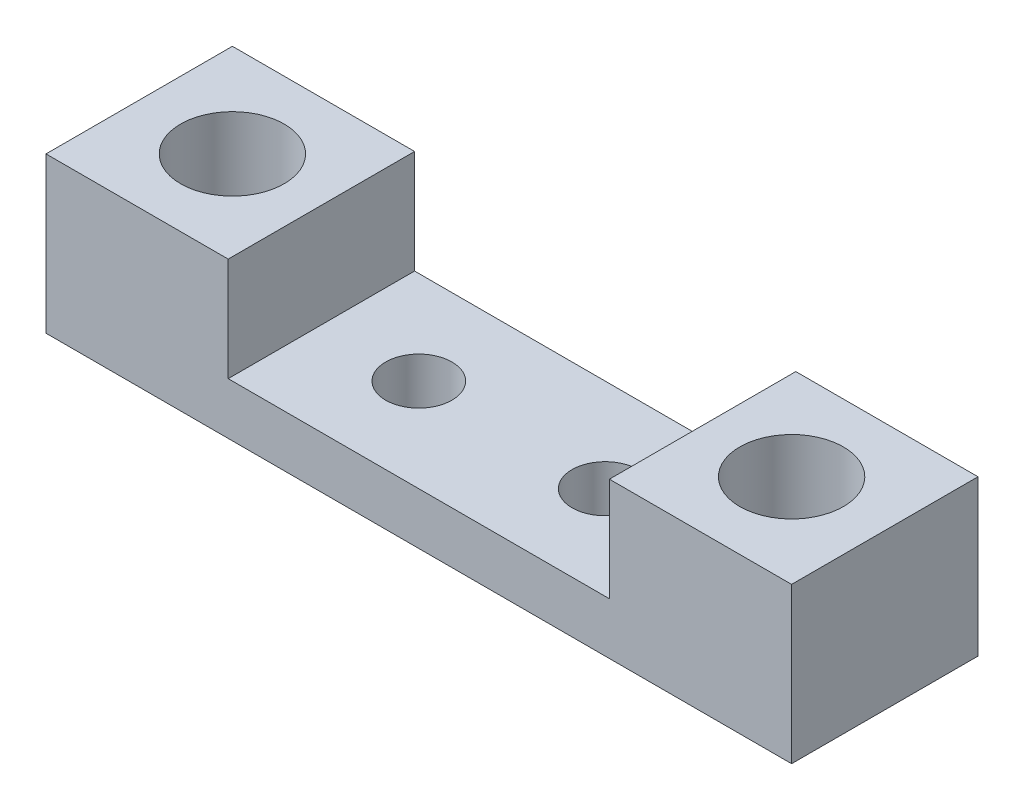
ISO-10303-21;
HEADER;
FILE_DESCRIPTION(('STEP AP214'),'2;1');
FILE_NAME('part.step','',(''),(''),'','','');
FILE_SCHEMA(('AUTOMOTIVE_DESIGN { 1 0 10303 214 1 1 1 1 }'));
ENDSEC;
DATA;
#1=APPLICATION_CONTEXT('core data for automotive mechanical design processes');
#2=APPLICATION_PROTOCOL_DEFINITION('international standard','automotive_design',2000,#1);
#3=PRODUCT_CONTEXT('',#1,'mechanical');
#4=PRODUCT('Part','Part','',(#3));
#5=PRODUCT_RELATED_PRODUCT_CATEGORY('part','',(#4));
#6=PRODUCT_DEFINITION_FORMATION('','',#4);
#7=PRODUCT_DEFINITION_CONTEXT('part definition',#1,'design');
#8=PRODUCT_DEFINITION('design','',#6,#7);
#9=PRODUCT_DEFINITION_SHAPE('','',#8);
#10=(LENGTH_UNIT() NAMED_UNIT(*) SI_UNIT(.MILLI.,.METRE.));
#11=(NAMED_UNIT(*) PLANE_ANGLE_UNIT() SI_UNIT($,.RADIAN.));
#12=(NAMED_UNIT(*) SI_UNIT($,.STERADIAN.) SOLID_ANGLE_UNIT());
#13=UNCERTAINTY_MEASURE_WITH_UNIT(LENGTH_MEASURE(1.E-05),#10,'distance_accuracy_value','');
#14=(GEOMETRIC_REPRESENTATION_CONTEXT(3) GLOBAL_UNCERTAINTY_ASSIGNED_CONTEXT((#13)) GLOBAL_UNIT_ASSIGNED_CONTEXT((#10,
#11,#12)) REPRESENTATION_CONTEXT('',''));
#15=CARTESIAN_POINT('',(0.,0.,0.));
#16=DIRECTION('',(0.,0.,1.));
#17=DIRECTION('',(1.,0.,0.));
#18=AXIS2_PLACEMENT_3D('',#15,#16,#17);
#19=CARTESIAN_POINT('',(0.,2.5,0.));
#20=DIRECTION('',(0.,1.,0.));
#21=DIRECTION('',(0.,0.,1.));
#22=AXIS2_PLACEMENT_3D('',#19,#20,#21);
#23=PLANE('',#22);
#24=CARTESIAN_POINT('',(-4.3541437719583,2.5,0.));
#25=DIRECTION('',(0.,1.,0.));
#26=DIRECTION('',(0.,0.,1.));
#27=AXIS2_PLACEMENT_3D('',#24,#25,#26);
#28=CIRCLE('',#27,1.6);
#29=CARTESIAN_POINT('',(-4.3541437719583,2.5,1.6));
#30=VERTEX_POINT('',#29);
#31=EDGE_CURVE('E162',#30,#30,#28,.T.);
#32=ORIENTED_EDGE('',*,*,#31,.F.);
#33=EDGE_LOOP('',(#32));
#34=FACE_BOUND('',#33,.T.);
#35=CARTESIAN_POINT('',(-13.3541437719583,2.5,0.));
#36=DIRECTION('',(0.,1.,0.));
#37=DIRECTION('',(0.,0.,1.));
#38=AXIS2_PLACEMENT_3D('',#35,#36,#37);
#39=CIRCLE('',#38,1.6);
#40=CARTESIAN_POINT('',(-13.3541437719583,2.5,1.6));
#41=VERTEX_POINT('',#40);
#42=EDGE_CURVE('E168',#41,#41,#39,.T.);
#43=ORIENTED_EDGE('',*,*,#42,.F.);
#44=EDGE_LOOP('',(#43));
#45=FACE_BOUND('',#44,.T.);
#46=DIRECTION('',(1.,0.,0.));
#47=VECTOR('',#46,1.);
#48=CARTESIAN_POINT('',(-26.8541437719583,2.5,4.5));
#49=LINE('',#48,#47);
#50=CARTESIAN_POINT('',(-18.0573972658692,2.5,4.5));
#51=VERTEX_POINT('',#50);
#52=CARTESIAN_POINT('',(0.349109721952637,2.5,4.5));
#53=VERTEX_POINT('',#52);
#54=EDGE_CURVE('E48',#51,#53,#49,.T.);
#55=ORIENTED_EDGE('',*,*,#54,.T.);
#56=DIRECTION('',(0.,0.,1.));
#57=VECTOR('',#56,1.);
#58=CARTESIAN_POINT('',(0.349109721952637,2.5,-4.5));
#59=LINE('',#58,#57);
#60=CARTESIAN_POINT('',(0.349109721952637,2.5,-4.5));
#61=VERTEX_POINT('',#60);
#62=EDGE_CURVE('E123',#61,#53,#59,.T.);
#63=ORIENTED_EDGE('',*,*,#62,.F.);
#64=DIRECTION('',(-1.,0.,0.));
#65=VECTOR('',#64,1.);
#66=CARTESIAN_POINT('',(-26.8541437719583,2.5,-4.5));
#67=LINE('',#66,#65);
#68=CARTESIAN_POINT('',(-18.0573972658692,2.5,-4.5));
#69=VERTEX_POINT('',#68);
#70=EDGE_CURVE('E175',#61,#69,#67,.T.);
#71=ORIENTED_EDGE('',*,*,#70,.T.);
#72=DIRECTION('',(0.,0.,-1.));
#73=VECTOR('',#72,1.);
#74=CARTESIAN_POINT('',(-18.0573972658692,2.5,-4.5));
#75=LINE('',#74,#73);
#76=EDGE_CURVE('E53',#51,#69,#75,.T.);
#77=ORIENTED_EDGE('',*,*,#76,.F.);
#78=EDGE_LOOP('',(#55,#63,#71,#77));
#79=FACE_BOUND('',#78,.T.);
#80=ADVANCED_FACE('F33',(#34,#45,#79),#23,.T.);
#81=CARTESIAN_POINT('',(0.,0.,0.));
#82=DIRECTION('',(0.,1.,0.));
#83=DIRECTION('',(0.,0.,1.));
#84=AXIS2_PLACEMENT_3D('',#81,#82,#83);
#85=PLANE('',#84);
#86=DIRECTION('',(0.,0.,1.));
#87=VECTOR('',#86,1.);
#88=CARTESIAN_POINT('',(-26.8541437719583,0.,-4.5));
#89=LINE('',#88,#87);
#90=CARTESIAN_POINT('',(-26.8541437719583,0.,-4.5));
#91=VERTEX_POINT('',#90);
#92=CARTESIAN_POINT('',(-26.8541437719583,0.,4.5));
#93=VERTEX_POINT('',#92);
#94=EDGE_CURVE('E171',#91,#93,#89,.T.);
#95=ORIENTED_EDGE('',*,*,#94,.F.);
#96=DIRECTION('',(-1.,0.,0.));
#97=VECTOR('',#96,1.);
#98=CARTESIAN_POINT('',(-26.8541437719583,0.,-4.5));
#99=LINE('',#98,#97);
#100=CARTESIAN_POINT('',(9.1458562280417,0.,-4.5));
#101=VERTEX_POINT('',#100);
#102=EDGE_CURVE('E176',#101,#91,#99,.T.);
#103=ORIENTED_EDGE('',*,*,#102,.F.);
#104=DIRECTION('',(0.,0.,-1.));
#105=VECTOR('',#104,1.);
#106=CARTESIAN_POINT('',(9.1458562280417,0.,-4.5));
#107=LINE('',#106,#105);
#108=CARTESIAN_POINT('',(9.1458562280417,0.,4.5));
#109=VERTEX_POINT('',#108);
#110=EDGE_CURVE('E104',#109,#101,#107,.T.);
#111=ORIENTED_EDGE('',*,*,#110,.F.);
#112=DIRECTION('',(1.,0.,0.));
#113=VECTOR('',#112,1.);
#114=CARTESIAN_POINT('',(-26.8541437719583,0.,4.5));
#115=LINE('',#114,#113);
#116=EDGE_CURVE('E180',#93,#109,#115,.T.);
#117=ORIENTED_EDGE('',*,*,#116,.F.);
#118=EDGE_LOOP('',(#95,#103,#111,#117));
#119=FACE_BOUND('',#118,.T.);
#120=CARTESIAN_POINT('',(-13.3541437719583,0.,0.));
#121=DIRECTION('',(0.,1.,0.));
#122=DIRECTION('',(0.,0.,1.));
#123=AXIS2_PLACEMENT_3D('',#120,#121,#122);
#124=CIRCLE('',#123,1.6);
#125=CARTESIAN_POINT('',(-13.3541437719583,0.,1.6));
#126=VERTEX_POINT('',#125);
#127=EDGE_CURVE('E165',#126,#126,#124,.T.);
#128=ORIENTED_EDGE('',*,*,#127,.T.);
#129=EDGE_LOOP('',(#128));
#130=FACE_BOUND('',#129,.T.);
#131=CARTESIAN_POINT('',(-4.3541437719583,0.,0.));
#132=DIRECTION('',(0.,1.,0.));
#133=DIRECTION('',(0.,0.,1.));
#134=AXIS2_PLACEMENT_3D('',#131,#132,#133);
#135=CIRCLE('',#134,1.6);
#136=CARTESIAN_POINT('',(-4.3541437719583,0.,1.6));
#137=VERTEX_POINT('',#136);
#138=EDGE_CURVE('E161',#137,#137,#135,.T.);
#139=ORIENTED_EDGE('',*,*,#138,.T.);
#140=EDGE_LOOP('',(#139));
#141=FACE_BOUND('',#140,.T.);
#142=CARTESIAN_POINT('',(4.6458562280417,0.,0.));
#143=DIRECTION('',(0.,1.,0.));
#144=DIRECTION('',(0.,0.,1.));
#145=AXIS2_PLACEMENT_3D('',#142,#143,#144);
#146=CIRCLE('',#145,2.5);
#147=CARTESIAN_POINT('',(4.6458562280417,0.,2.5));
#148=VERTEX_POINT('',#147);
#149=EDGE_CURVE('E158',#148,#148,#146,.T.);
#150=ORIENTED_EDGE('',*,*,#149,.T.);
#151=EDGE_LOOP('',(#150));
#152=FACE_BOUND('',#151,.T.);
#153=CARTESIAN_POINT('',(-22.3541437719583,0.,0.));
#154=DIRECTION('',(0.,1.,0.));
#155=DIRECTION('',(0.,0.,1.));
#156=AXIS2_PLACEMENT_3D('',#153,#154,#155);
#157=CIRCLE('',#156,2.5);
#158=CARTESIAN_POINT('',(-22.3541437719583,0.,2.5));
#159=VERTEX_POINT('',#158);
#160=EDGE_CURVE('E155',#159,#159,#157,.T.);
#161=ORIENTED_EDGE('',*,*,#160,.T.);
#162=EDGE_LOOP('',(#161));
#163=FACE_BOUND('',#162,.T.);
#164=ADVANCED_FACE('F188',(#119,#130,#141,#152,#163),#85,.F.);
#165=CARTESIAN_POINT('',(-26.8541437719583,2.5,-4.5));
#166=DIRECTION('',(1.,0.,0.));
#167=DIRECTION('',(0.,0.,-1.));
#168=AXIS2_PLACEMENT_3D('',#165,#166,#167);
#169=PLANE('',#168);
#170=ORIENTED_EDGE('',*,*,#94,.T.);
#171=DIRECTION('',(0.,-1.,0.));
#172=VECTOR('',#171,1.);
#173=CARTESIAN_POINT('',(-26.8541437719583,2.5,4.5));
#174=LINE('',#173,#172);
#175=CARTESIAN_POINT('',(-26.8541437719583,7.5,4.5));
#176=VERTEX_POINT('',#175);
#177=EDGE_CURVE('E11',#176,#93,#174,.T.);
#178=ORIENTED_EDGE('',*,*,#177,.F.);
#179=DIRECTION('',(0.,0.,1.));
#180=VECTOR('',#179,1.);
#181=CARTESIAN_POINT('',(-26.8541437719583,7.5,-4.5));
#182=LINE('',#181,#180);
#183=CARTESIAN_POINT('',(-26.8541437719583,7.5,-4.5));
#184=VERTEX_POINT('',#183);
#185=EDGE_CURVE('E138',#184,#176,#182,.T.);
#186=ORIENTED_EDGE('',*,*,#185,.F.);
#187=DIRECTION('',(0.,-1.,0.));
#188=VECTOR('',#187,1.);
#189=CARTESIAN_POINT('',(-26.8541437719583,2.5,-4.5));
#190=LINE('',#189,#188);
#191=EDGE_CURVE('E107',#184,#91,#190,.T.);
#192=ORIENTED_EDGE('',*,*,#191,.T.);
#193=EDGE_LOOP('',(#170,#178,#186,#192));
#194=FACE_BOUND('',#193,.T.);
#195=ADVANCED_FACE('F35',(#194),#169,.F.);
#196=CARTESIAN_POINT('',(-26.8541437719583,2.5,4.5));
#197=DIRECTION('',(0.,0.,-1.));
#198=DIRECTION('',(-1.,0.,0.));
#199=AXIS2_PLACEMENT_3D('',#196,#197,#198);
#200=PLANE('',#199);
#201=ORIENTED_EDGE('',*,*,#116,.T.);
#202=DIRECTION('',(0.,-1.,0.));
#203=VECTOR('',#202,1.);
#204=CARTESIAN_POINT('',(9.1458562280417,2.5,4.5));
#205=LINE('',#204,#203);
#206=CARTESIAN_POINT('',(9.1458562280417,7.5,4.5));
#207=VERTEX_POINT('',#206);
#208=EDGE_CURVE('E41',#207,#109,#205,.T.);
#209=ORIENTED_EDGE('',*,*,#208,.F.);
#210=DIRECTION('',(1.,0.,0.));
#211=VECTOR('',#210,1.);
#212=CARTESIAN_POINT('',(9.1458562280417,7.5,4.5));
#213=LINE('',#212,#211);
#214=CARTESIAN_POINT('',(0.349109721952637,7.5,4.5));
#215=VERTEX_POINT('',#214);
#216=EDGE_CURVE('E122',#215,#207,#213,.T.);
#217=ORIENTED_EDGE('',*,*,#216,.F.);
#218=DIRECTION('',(0.,-1.,0.));
#219=VECTOR('',#218,1.);
#220=CARTESIAN_POINT('',(0.349109721952637,7.5,4.5));
#221=LINE('',#220,#219);
#222=EDGE_CURVE('E130',#215,#53,#221,.T.);
#223=ORIENTED_EDGE('',*,*,#222,.T.);
#224=ORIENTED_EDGE('',*,*,#54,.F.);
#225=DIRECTION('',(0.,-1.,0.));
#226=VECTOR('',#225,1.);
#227=CARTESIAN_POINT('',(-18.0573972658692,7.5,4.5));
#228=LINE('',#227,#226);
#229=CARTESIAN_POINT('',(-18.0573972658692,7.5,4.5));
#230=VERTEX_POINT('',#229);
#231=EDGE_CURVE('E152',#230,#51,#228,.T.);
#232=ORIENTED_EDGE('',*,*,#231,.F.);
#233=DIRECTION('',(1.,0.,0.));
#234=VECTOR('',#233,1.);
#235=CARTESIAN_POINT('',(-26.8541437719583,7.5,4.5));
#236=LINE('',#235,#234);
#237=EDGE_CURVE('E141',#176,#230,#236,.T.);
#238=ORIENTED_EDGE('',*,*,#237,.F.);
#239=ORIENTED_EDGE('',*,*,#177,.T.);
#240=EDGE_LOOP('',(#201,#209,#217,#223,#224,#232,#238,#239));
#241=FACE_BOUND('',#240,.T.);
#242=ADVANCED_FACE('F202',(#241),#200,.F.);
#243=CARTESIAN_POINT('',(9.1458562280417,2.5,-4.5));
#244=DIRECTION('',(-1.,0.,0.));
#245=DIRECTION('',(0.,0.,1.));
#246=AXIS2_PLACEMENT_3D('',#243,#244,#245);
#247=PLANE('',#246);
#248=ORIENTED_EDGE('',*,*,#110,.T.);
#249=DIRECTION('',(0.,-1.,0.));
#250=VECTOR('',#249,1.);
#251=CARTESIAN_POINT('',(9.1458562280417,2.5,-4.5));
#252=LINE('',#251,#250);
#253=CARTESIAN_POINT('',(9.1458562280417,7.5,-4.5));
#254=VERTEX_POINT('',#253);
#255=EDGE_CURVE('E97',#254,#101,#252,.T.);
#256=ORIENTED_EDGE('',*,*,#255,.F.);
#257=DIRECTION('',(0.,0.,-1.));
#258=VECTOR('',#257,1.);
#259=CARTESIAN_POINT('',(9.1458562280417,7.5,-4.5));
#260=LINE('',#259,#258);
#261=EDGE_CURVE('E102',#207,#254,#260,.T.);
#262=ORIENTED_EDGE('',*,*,#261,.F.);
#263=ORIENTED_EDGE('',*,*,#208,.T.);
#264=EDGE_LOOP('',(#248,#256,#262,#263));
#265=FACE_BOUND('',#264,.T.);
#266=ADVANCED_FACE('F99',(#265),#247,.F.);
#267=CARTESIAN_POINT('',(-26.8541437719583,2.5,-4.5));
#268=DIRECTION('',(0.,0.,1.));
#269=DIRECTION('',(1.,0.,0.));
#270=AXIS2_PLACEMENT_3D('',#267,#268,#269);
#271=PLANE('',#270);
#272=ORIENTED_EDGE('',*,*,#102,.T.);
#273=ORIENTED_EDGE('',*,*,#191,.F.);
#274=DIRECTION('',(-1.,0.,0.));
#275=VECTOR('',#274,1.);
#276=CARTESIAN_POINT('',(-26.8541437719583,7.5,-4.5));
#277=LINE('',#276,#275);
#278=CARTESIAN_POINT('',(-18.0573972658692,7.5,-4.5));
#279=VERTEX_POINT('',#278);
#280=EDGE_CURVE('E145',#279,#184,#277,.T.);
#281=ORIENTED_EDGE('',*,*,#280,.F.);
#282=DIRECTION('',(0.,-1.,0.));
#283=VECTOR('',#282,1.);
#284=CARTESIAN_POINT('',(-18.0573972658692,7.5,-4.5));
#285=LINE('',#284,#283);
#286=EDGE_CURVE('E148',#279,#69,#285,.T.);
#287=ORIENTED_EDGE('',*,*,#286,.T.);
#288=ORIENTED_EDGE('',*,*,#70,.F.);
#289=DIRECTION('',(0.,-1.,0.));
#290=VECTOR('',#289,1.);
#291=CARTESIAN_POINT('',(0.349109721952637,7.5,-4.5));
#292=LINE('',#291,#290);
#293=CARTESIAN_POINT('',(0.349109721952637,7.5,-4.5));
#294=VERTEX_POINT('',#293);
#295=EDGE_CURVE('E113',#294,#61,#292,.T.);
#296=ORIENTED_EDGE('',*,*,#295,.F.);
#297=DIRECTION('',(-1.,0.,0.));
#298=VECTOR('',#297,1.);
#299=CARTESIAN_POINT('',(9.1458562280417,7.5,-4.5));
#300=LINE('',#299,#298);
#301=EDGE_CURVE('E110',#254,#294,#300,.T.);
#302=ORIENTED_EDGE('',*,*,#301,.F.);
#303=ORIENTED_EDGE('',*,*,#255,.T.);
#304=EDGE_LOOP('',(#272,#273,#281,#287,#288,#296,#302,#303));
#305=FACE_BOUND('',#304,.T.);
#306=ADVANCED_FACE('F111',(#305),#271,.F.);
#307=CARTESIAN_POINT('',(-13.3541437719583,2.5,0.));
#308=DIRECTION('',(0.,-1.,0.));
#309=DIRECTION('',(0.,0.,-1.));
#310=AXIS2_PLACEMENT_3D('',#307,#308,#309);
#311=CYLINDRICAL_SURFACE('',#310,1.6);
#312=ORIENTED_EDGE('',*,*,#42,.T.);
#313=EDGE_LOOP('',(#312));
#314=FACE_BOUND('',#313,.T.);
#315=ORIENTED_EDGE('',*,*,#127,.F.);
#316=EDGE_LOOP('',(#315));
#317=FACE_BOUND('',#316,.T.);
#318=ADVANCED_FACE('F216',(#314,#317),#311,.F.);
#319=CARTESIAN_POINT('',(-4.3541437719583,2.5,0.));
#320=DIRECTION('',(0.,-1.,0.));
#321=DIRECTION('',(0.,0.,-1.));
#322=AXIS2_PLACEMENT_3D('',#319,#320,#321);
#323=CYLINDRICAL_SURFACE('',#322,1.6);
#324=ORIENTED_EDGE('',*,*,#31,.T.);
#325=EDGE_LOOP('',(#324));
#326=FACE_BOUND('',#325,.T.);
#327=ORIENTED_EDGE('',*,*,#138,.F.);
#328=EDGE_LOOP('',(#327));
#329=FACE_BOUND('',#328,.T.);
#330=ADVANCED_FACE('F242',(#326,#329),#323,.F.);
#331=CARTESIAN_POINT('',(4.6458562280417,2.5,0.));
#332=DIRECTION('',(0.,-1.,0.));
#333=DIRECTION('',(0.,0.,-1.));
#334=AXIS2_PLACEMENT_3D('',#331,#332,#333);
#335=CYLINDRICAL_SURFACE('',#334,2.5);
#336=ORIENTED_EDGE('',*,*,#149,.F.);
#337=EDGE_LOOP('',(#336));
#338=FACE_BOUND('',#337,.T.);
#339=CARTESIAN_POINT('',(4.6458562280417,7.5,0.));
#340=DIRECTION('',(0.,1.,0.));
#341=DIRECTION('',(0.,0.,1.));
#342=AXIS2_PLACEMENT_3D('',#339,#340,#341);
#343=CIRCLE('',#342,2.5);
#344=CARTESIAN_POINT('',(4.6458562280417,7.5,2.5));
#345=VERTEX_POINT('',#344);
#346=EDGE_CURVE('E125',#345,#345,#343,.T.);
#347=ORIENTED_EDGE('',*,*,#346,.T.);
#348=EDGE_LOOP('',(#347));
#349=FACE_BOUND('',#348,.T.);
#350=ADVANCED_FACE('F251',(#338,#349),#335,.F.);
#351=CARTESIAN_POINT('',(-22.3541437719583,2.5,0.));
#352=DIRECTION('',(0.,-1.,0.));
#353=DIRECTION('',(0.,0.,-1.));
#354=AXIS2_PLACEMENT_3D('',#351,#352,#353);
#355=CYLINDRICAL_SURFACE('',#354,2.5);
#356=ORIENTED_EDGE('',*,*,#160,.F.);
#357=EDGE_LOOP('',(#356));
#358=FACE_BOUND('',#357,.T.);
#359=CARTESIAN_POINT('',(-22.3541437719583,7.5,0.));
#360=DIRECTION('',(0.,1.,0.));
#361=DIRECTION('',(0.,0.,1.));
#362=AXIS2_PLACEMENT_3D('',#359,#360,#361);
#363=CIRCLE('',#362,2.5);
#364=CARTESIAN_POINT('',(-22.3541437719583,7.5,2.5));
#365=VERTEX_POINT('',#364);
#366=EDGE_CURVE('E135',#365,#365,#363,.T.);
#367=ORIENTED_EDGE('',*,*,#366,.T.);
#368=EDGE_LOOP('',(#367));
#369=FACE_BOUND('',#368,.T.);
#370=ADVANCED_FACE('F263',(#358,#369),#355,.F.);
#371=CARTESIAN_POINT('',(0.,7.5,0.));
#372=DIRECTION('',(0.,1.,0.));
#373=DIRECTION('',(0.,0.,1.));
#374=AXIS2_PLACEMENT_3D('',#371,#372,#373);
#375=PLANE('',#374);
#376=ORIENTED_EDGE('',*,*,#185,.T.);
#377=ORIENTED_EDGE('',*,*,#237,.T.);
#378=DIRECTION('',(0.,0.,-1.));
#379=VECTOR('',#378,1.);
#380=CARTESIAN_POINT('',(-18.0573972658692,7.5,-4.5));
#381=LINE('',#380,#379);
#382=EDGE_CURVE('E143',#230,#279,#381,.T.);
#383=ORIENTED_EDGE('',*,*,#382,.T.);
#384=ORIENTED_EDGE('',*,*,#280,.T.);
#385=EDGE_LOOP('',(#376,#377,#383,#384));
#386=FACE_BOUND('',#385,.T.);
#387=ORIENTED_EDGE('',*,*,#366,.F.);
#388=EDGE_LOOP('',(#387));
#389=FACE_BOUND('',#388,.T.);
#390=ADVANCED_FACE('F195',(#386,#389),#375,.T.);
#391=CARTESIAN_POINT('',(-18.0573972658692,7.5,-4.5));
#392=DIRECTION('',(-1.,0.,0.));
#393=DIRECTION('',(0.,0.,1.));
#394=AXIS2_PLACEMENT_3D('',#391,#392,#393);
#395=PLANE('',#394);
#396=ORIENTED_EDGE('',*,*,#76,.T.);
#397=ORIENTED_EDGE('',*,*,#286,.F.);
#398=ORIENTED_EDGE('',*,*,#382,.F.);
#399=ORIENTED_EDGE('',*,*,#231,.T.);
#400=EDGE_LOOP('',(#396,#397,#398,#399));
#401=FACE_BOUND('',#400,.T.);
#402=ADVANCED_FACE('F201',(#401),#395,.F.);
#403=CARTESIAN_POINT('',(0.,7.5,0.));
#404=DIRECTION('',(0.,-1.,0.));
#405=DIRECTION('',(0.,0.,-1.));
#406=AXIS2_PLACEMENT_3D('',#403,#404,#405);
#407=PLANE('',#406);
#408=ORIENTED_EDGE('',*,*,#261,.T.);
#409=ORIENTED_EDGE('',*,*,#301,.T.);
#410=DIRECTION('',(0.,0.,1.));
#411=VECTOR('',#410,1.);
#412=CARTESIAN_POINT('',(0.349109721952637,7.5,-4.5));
#413=LINE('',#412,#411);
#414=EDGE_CURVE('E116',#294,#215,#413,.T.);
#415=ORIENTED_EDGE('',*,*,#414,.T.);
#416=ORIENTED_EDGE('',*,*,#216,.T.);
#417=EDGE_LOOP('',(#408,#409,#415,#416));
#418=FACE_BOUND('',#417,.T.);
#419=ORIENTED_EDGE('',*,*,#346,.F.);
#420=EDGE_LOOP('',(#419));
#421=FACE_BOUND('',#420,.T.);
#422=ADVANCED_FACE('F119',(#418,#421),#407,.F.);
#423=CARTESIAN_POINT('',(0.349109721952637,7.5,-4.5));
#424=DIRECTION('',(1.,0.,0.));
#425=DIRECTION('',(0.,0.,-1.));
#426=AXIS2_PLACEMENT_3D('',#423,#424,#425);
#427=PLANE('',#426);
#428=ORIENTED_EDGE('',*,*,#62,.T.);
#429=ORIENTED_EDGE('',*,*,#222,.F.);
#430=ORIENTED_EDGE('',*,*,#414,.F.);
#431=ORIENTED_EDGE('',*,*,#295,.T.);
#432=EDGE_LOOP('',(#428,#429,#430,#431));
#433=FACE_BOUND('',#432,.T.);
#434=ADVANCED_FACE('F205',(#433),#427,.F.);
#435=CLOSED_SHELL('',(#80,#164,#195,#242,#266,#306,#318,#330,#350,#370,#390,#402,#422,#434));
#436=MANIFOLD_SOLID_BREP('B2',#435);
#437=ADVANCED_BREP_SHAPE_REPRESENTATION('',(#18,#436),#14);
#438=SHAPE_DEFINITION_REPRESENTATION(#9,#437);
ENDSEC;
END-ISO-10303-21;
